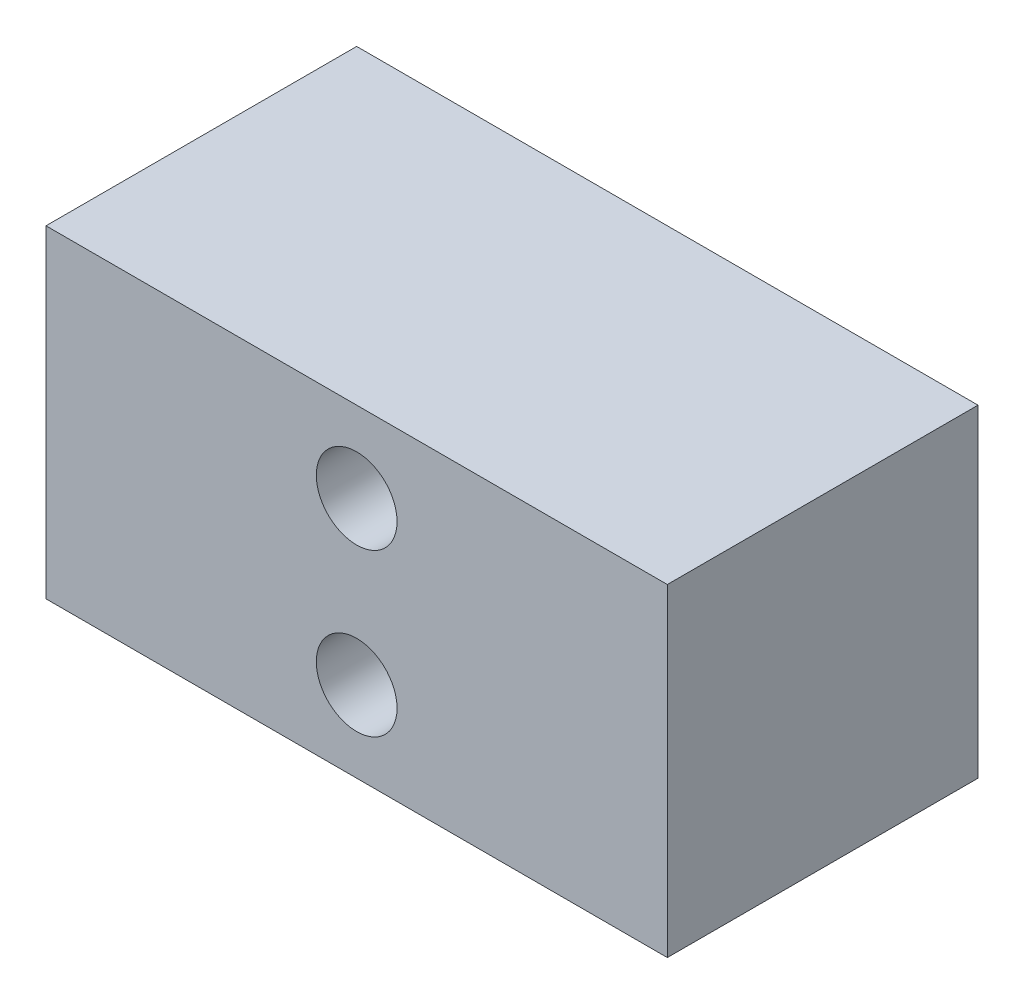
ISO-10303-21;
HEADER;
FILE_DESCRIPTION(('STEP AP214'),'2;1');
FILE_NAME('part.step','',(''),(''),'','','');
FILE_SCHEMA(('AUTOMOTIVE_DESIGN { 1 0 10303 214 1 1 1 1 }'));
ENDSEC;
DATA;
#1=APPLICATION_CONTEXT('core data for automotive mechanical design processes');
#2=APPLICATION_PROTOCOL_DEFINITION('international standard','automotive_design',2000,#1);
#3=PRODUCT_CONTEXT('',#1,'mechanical');
#4=PRODUCT('Part','Part','',(#3));
#5=PRODUCT_RELATED_PRODUCT_CATEGORY('part','',(#4));
#6=PRODUCT_DEFINITION_FORMATION('','',#4);
#7=PRODUCT_DEFINITION_CONTEXT('part definition',#1,'design');
#8=PRODUCT_DEFINITION('design','',#6,#7);
#9=PRODUCT_DEFINITION_SHAPE('','',#8);
#10=(LENGTH_UNIT() NAMED_UNIT(*) SI_UNIT(.MILLI.,.METRE.));
#11=(NAMED_UNIT(*) PLANE_ANGLE_UNIT() SI_UNIT($,.RADIAN.));
#12=(NAMED_UNIT(*) SI_UNIT($,.STERADIAN.) SOLID_ANGLE_UNIT());
#13=UNCERTAINTY_MEASURE_WITH_UNIT(LENGTH_MEASURE(1.E-05),#10,'distance_accuracy_value','');
#14=(GEOMETRIC_REPRESENTATION_CONTEXT(3) GLOBAL_UNCERTAINTY_ASSIGNED_CONTEXT((#13)) GLOBAL_UNIT_ASSIGNED_CONTEXT((#10,
#11,#12)) REPRESENTATION_CONTEXT('',''));
#15=CARTESIAN_POINT('',(0.,0.,0.));
#16=DIRECTION('',(0.,0.,1.));
#17=DIRECTION('',(1.,0.,0.));
#18=AXIS2_PLACEMENT_3D('',#15,#16,#17);
#19=CARTESIAN_POINT('',(0.,0.,25.4));
#20=DIRECTION('',(0.,0.,-1.));
#21=DIRECTION('',(-1.,0.,0.));
#22=AXIS2_PLACEMENT_3D('',#19,#20,#21);
#23=PLANE('',#22);
#24=DIRECTION('',(0.,-1.,0.));
#25=VECTOR('',#24,1.);
#26=CARTESIAN_POINT('',(0.,0.,25.4));
#27=LINE('',#26,#25);
#28=CARTESIAN_POINT('',(0.,26.416,25.4));
#29=VERTEX_POINT('',#28);
#30=CARTESIAN_POINT('',(0.,0.,25.4));
#31=VERTEX_POINT('',#30);
#32=EDGE_CURVE('E94',#29,#31,#27,.T.);
#33=ORIENTED_EDGE('',*,*,#32,.T.);
#34=DIRECTION('',(1.,0.,0.));
#35=VECTOR('',#34,1.);
#36=CARTESIAN_POINT('',(0.,0.,25.4));
#37=LINE('',#36,#35);
#38=CARTESIAN_POINT('',(50.8,0.,25.4));
#39=VERTEX_POINT('',#38);
#40=EDGE_CURVE('E89',#31,#39,#37,.T.);
#41=ORIENTED_EDGE('',*,*,#40,.T.);
#42=DIRECTION('',(0.,1.,0.));
#43=VECTOR('',#42,1.);
#44=CARTESIAN_POINT('',(50.8,0.,25.4));
#45=LINE('',#44,#43);
#46=CARTESIAN_POINT('',(50.8,26.416,25.4));
#47=VERTEX_POINT('',#46);
#48=EDGE_CURVE('E92',#39,#47,#45,.T.);
#49=ORIENTED_EDGE('',*,*,#48,.T.);
#50=DIRECTION('',(-1.,0.,0.));
#51=VECTOR('',#50,1.);
#52=CARTESIAN_POINT('',(0.,26.416,25.4));
#53=LINE('',#52,#51);
#54=EDGE_CURVE('E59',#47,#29,#53,.T.);
#55=ORIENTED_EDGE('',*,*,#54,.T.);
#56=EDGE_LOOP('',(#33,#41,#49,#55));
#57=FACE_BOUND('',#56,.T.);
#58=CARTESIAN_POINT('',(25.4,19.812,25.4));
#59=DIRECTION('',(0.,0.,1.));
#60=DIRECTION('',(1.,0.,0.));
#61=AXIS2_PLACEMENT_3D('',#58,#59,#60);
#62=CIRCLE('',#61,3.302);
#63=CARTESIAN_POINT('',(28.702,19.812,25.4));
#64=VERTEX_POINT('',#63);
#65=EDGE_CURVE('E114',#64,#64,#62,.T.);
#66=ORIENTED_EDGE('',*,*,#65,.F.);
#67=EDGE_LOOP('',(#66));
#68=FACE_BOUND('',#67,.T.);
#69=CARTESIAN_POINT('',(25.4,6.604,25.4));
#70=DIRECTION('',(0.,0.,1.));
#71=DIRECTION('',(1.,0.,0.));
#72=AXIS2_PLACEMENT_3D('',#69,#70,#71);
#73=CIRCLE('',#72,3.302);
#74=CARTESIAN_POINT('',(28.702,6.604,25.4));
#75=VERTEX_POINT('',#74);
#76=EDGE_CURVE('E136',#75,#75,#73,.T.);
#77=ORIENTED_EDGE('',*,*,#76,.F.);
#78=EDGE_LOOP('',(#77));
#79=FACE_BOUND('',#78,.T.);
#80=ADVANCED_FACE('F41',(#57,#68,#79),#23,.F.);
#81=CARTESIAN_POINT('',(0.,0.,0.));
#82=DIRECTION('',(0.,0.,-1.));
#83=DIRECTION('',(-1.,0.,0.));
#84=AXIS2_PLACEMENT_3D('',#81,#82,#83);
#85=PLANE('',#84);
#86=CARTESIAN_POINT('',(25.4,19.812,0.));
#87=DIRECTION('',(0.,0.,1.));
#88=DIRECTION('',(1.,0.,0.));
#89=AXIS2_PLACEMENT_3D('',#86,#87,#88);
#90=CIRCLE('',#89,3.302);
#91=CARTESIAN_POINT('',(28.702,19.812,0.));
#92=VERTEX_POINT('',#91);
#93=EDGE_CURVE('E132',#92,#92,#90,.T.);
#94=ORIENTED_EDGE('',*,*,#93,.T.);
#95=EDGE_LOOP('',(#94));
#96=FACE_BOUND('',#95,.T.);
#97=DIRECTION('',(0.,-1.,0.));
#98=VECTOR('',#97,1.);
#99=CARTESIAN_POINT('',(0.,0.,0.));
#100=LINE('',#99,#98);
#101=CARTESIAN_POINT('',(0.,26.416,0.));
#102=VERTEX_POINT('',#101);
#103=CARTESIAN_POINT('',(0.,0.,0.));
#104=VERTEX_POINT('',#103);
#105=EDGE_CURVE('E110',#102,#104,#100,.T.);
#106=ORIENTED_EDGE('',*,*,#105,.F.);
#107=DIRECTION('',(-1.,0.,0.));
#108=VECTOR('',#107,1.);
#109=CARTESIAN_POINT('',(0.,26.416,0.));
#110=LINE('',#109,#108);
#111=CARTESIAN_POINT('',(50.8,26.416,0.));
#112=VERTEX_POINT('',#111);
#113=EDGE_CURVE('E82',#112,#102,#110,.T.);
#114=ORIENTED_EDGE('',*,*,#113,.F.);
#115=DIRECTION('',(0.,1.,0.));
#116=VECTOR('',#115,1.);
#117=CARTESIAN_POINT('',(50.8,0.,0.));
#118=LINE('',#117,#116);
#119=CARTESIAN_POINT('',(50.8,0.,0.));
#120=VERTEX_POINT('',#119);
#121=EDGE_CURVE('E76',#120,#112,#118,.T.);
#122=ORIENTED_EDGE('',*,*,#121,.F.);
#123=DIRECTION('',(1.,0.,0.));
#124=VECTOR('',#123,1.);
#125=CARTESIAN_POINT('',(0.,0.,0.));
#126=LINE('',#125,#124);
#127=EDGE_CURVE('E99',#104,#120,#126,.T.);
#128=ORIENTED_EDGE('',*,*,#127,.F.);
#129=EDGE_LOOP('',(#106,#114,#122,#128));
#130=FACE_BOUND('',#129,.T.);
#131=CARTESIAN_POINT('',(25.4,6.604,0.));
#132=DIRECTION('',(0.,0.,1.));
#133=DIRECTION('',(1.,0.,0.));
#134=AXIS2_PLACEMENT_3D('',#131,#132,#133);
#135=CIRCLE('',#134,3.302);
#136=CARTESIAN_POINT('',(28.702,6.604,0.));
#137=VERTEX_POINT('',#136);
#138=EDGE_CURVE('E140',#137,#137,#135,.T.);
#139=ORIENTED_EDGE('',*,*,#138,.T.);
#140=EDGE_LOOP('',(#139));
#141=FACE_BOUND('',#140,.T.);
#142=ADVANCED_FACE('F127',(#96,#130,#141),#85,.T.);
#143=CARTESIAN_POINT('',(0.,0.,25.4));
#144=DIRECTION('',(1.,0.,0.));
#145=DIRECTION('',(0.,0.,-1.));
#146=AXIS2_PLACEMENT_3D('',#143,#144,#145);
#147=PLANE('',#146);
#148=ORIENTED_EDGE('',*,*,#105,.T.);
#149=DIRECTION('',(0.,0.,-1.));
#150=VECTOR('',#149,1.);
#151=CARTESIAN_POINT('',(0.,0.,25.4));
#152=LINE('',#151,#150);
#153=EDGE_CURVE('E11',#31,#104,#152,.T.);
#154=ORIENTED_EDGE('',*,*,#153,.F.);
#155=ORIENTED_EDGE('',*,*,#32,.F.);
#156=DIRECTION('',(0.,0.,-1.));
#157=VECTOR('',#156,1.);
#158=CARTESIAN_POINT('',(0.,26.416,25.4));
#159=LINE('',#158,#157);
#160=EDGE_CURVE('E106',#29,#102,#159,.T.);
#161=ORIENTED_EDGE('',*,*,#160,.T.);
#162=EDGE_LOOP('',(#148,#154,#155,#161));
#163=FACE_BOUND('',#162,.T.);
#164=ADVANCED_FACE('F43',(#163),#147,.F.);
#165=CARTESIAN_POINT('',(0.,0.,25.4));
#166=DIRECTION('',(0.,1.,0.));
#167=DIRECTION('',(0.,0.,1.));
#168=AXIS2_PLACEMENT_3D('',#165,#166,#167);
#169=PLANE('',#168);
#170=ORIENTED_EDGE('',*,*,#127,.T.);
#171=DIRECTION('',(0.,0.,-1.));
#172=VECTOR('',#171,1.);
#173=CARTESIAN_POINT('',(50.8,0.,25.4));
#174=LINE('',#173,#172);
#175=EDGE_CURVE('E51',#39,#120,#174,.T.);
#176=ORIENTED_EDGE('',*,*,#175,.F.);
#177=ORIENTED_EDGE('',*,*,#40,.F.);
#178=ORIENTED_EDGE('',*,*,#153,.T.);
#179=EDGE_LOOP('',(#170,#176,#177,#178));
#180=FACE_BOUND('',#179,.T.);
#181=ADVANCED_FACE('F98',(#180),#169,.F.);
#182=CARTESIAN_POINT('',(50.8,0.,25.4));
#183=DIRECTION('',(-1.,0.,0.));
#184=DIRECTION('',(0.,0.,1.));
#185=AXIS2_PLACEMENT_3D('',#182,#183,#184);
#186=PLANE('',#185);
#187=ORIENTED_EDGE('',*,*,#121,.T.);
#188=DIRECTION('',(0.,0.,-1.));
#189=VECTOR('',#188,1.);
#190=CARTESIAN_POINT('',(50.8,26.416,25.4));
#191=LINE('',#190,#189);
#192=EDGE_CURVE('E101',#47,#112,#191,.T.);
#193=ORIENTED_EDGE('',*,*,#192,.F.);
#194=ORIENTED_EDGE('',*,*,#48,.F.);
#195=ORIENTED_EDGE('',*,*,#175,.T.);
#196=EDGE_LOOP('',(#187,#193,#194,#195));
#197=FACE_BOUND('',#196,.T.);
#198=ADVANCED_FACE('F102',(#197),#186,.F.);
#199=CARTESIAN_POINT('',(0.,26.416,25.4));
#200=DIRECTION('',(0.,-1.,0.));
#201=DIRECTION('',(0.,0.,-1.));
#202=AXIS2_PLACEMENT_3D('',#199,#200,#201);
#203=PLANE('',#202);
#204=ORIENTED_EDGE('',*,*,#113,.T.);
#205=ORIENTED_EDGE('',*,*,#160,.F.);
#206=ORIENTED_EDGE('',*,*,#54,.F.);
#207=ORIENTED_EDGE('',*,*,#192,.T.);
#208=EDGE_LOOP('',(#204,#205,#206,#207));
#209=FACE_BOUND('',#208,.T.);
#210=ADVANCED_FACE('F124',(#209),#203,.F.);
#211=CARTESIAN_POINT('',(25.4,19.812,25.4));
#212=DIRECTION('',(0.,0.,-1.));
#213=DIRECTION('',(-1.,0.,0.));
#214=AXIS2_PLACEMENT_3D('',#211,#212,#213);
#215=CYLINDRICAL_SURFACE('',#214,3.302);
#216=ORIENTED_EDGE('',*,*,#65,.T.);
#217=EDGE_LOOP('',(#216));
#218=FACE_BOUND('',#217,.T.);
#219=ORIENTED_EDGE('',*,*,#93,.F.);
#220=EDGE_LOOP('',(#219));
#221=FACE_BOUND('',#220,.T.);
#222=ADVANCED_FACE('F159',(#218,#221),#215,.F.);
#223=CARTESIAN_POINT('',(25.4,6.604,25.4));
#224=DIRECTION('',(0.,0.,-1.));
#225=DIRECTION('',(-1.,0.,0.));
#226=AXIS2_PLACEMENT_3D('',#223,#224,#225);
#227=CYLINDRICAL_SURFACE('',#226,3.302);
#228=ORIENTED_EDGE('',*,*,#76,.T.);
#229=EDGE_LOOP('',(#228));
#230=FACE_BOUND('',#229,.T.);
#231=ORIENTED_EDGE('',*,*,#138,.F.);
#232=EDGE_LOOP('',(#231));
#233=FACE_BOUND('',#232,.T.);
#234=ADVANCED_FACE('F148',(#230,#233),#227,.F.);
#235=CLOSED_SHELL('',(#80,#142,#164,#181,#198,#210,#222,#234));
#236=MANIFOLD_SOLID_BREP('B2',#235);
#237=ADVANCED_BREP_SHAPE_REPRESENTATION('',(#18,#236),#14);
#238=SHAPE_DEFINITION_REPRESENTATION(#9,#237);
ENDSEC;
END-ISO-10303-21;
